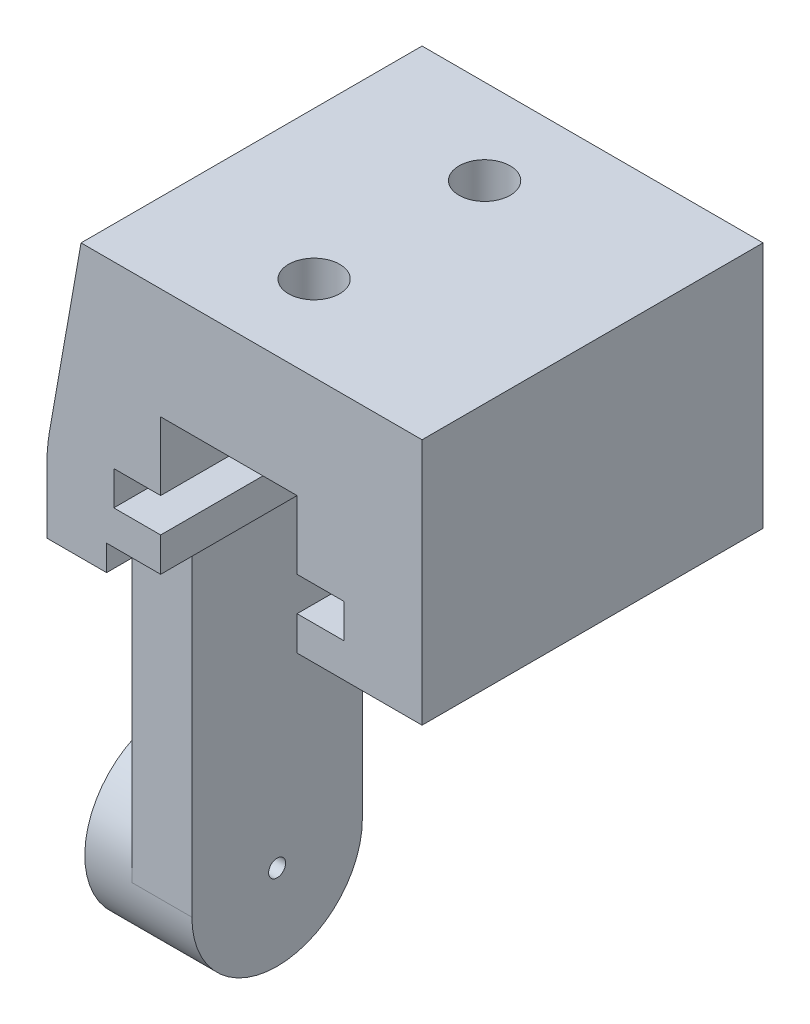
ISO-10303-21;
HEADER;
FILE_DESCRIPTION(('STEP AP214'),'2;1');
FILE_NAME('part.step','',(''),(''),'','','');
FILE_SCHEMA(('AUTOMOTIVE_DESIGN { 1 0 10303 214 1 1 1 1 }'));
ENDSEC;
DATA;
#1=APPLICATION_CONTEXT('core data for automotive mechanical design processes');
#2=APPLICATION_PROTOCOL_DEFINITION('international standard','automotive_design',2000,#1);
#3=PRODUCT_CONTEXT('',#1,'mechanical');
#4=PRODUCT('Part','Part','',(#3));
#5=PRODUCT_RELATED_PRODUCT_CATEGORY('part','',(#4));
#6=PRODUCT_DEFINITION_FORMATION('','',#4);
#7=PRODUCT_DEFINITION_CONTEXT('part definition',#1,'design');
#8=PRODUCT_DEFINITION('design','',#6,#7);
#9=PRODUCT_DEFINITION_SHAPE('','',#8);
#10=(LENGTH_UNIT() NAMED_UNIT(*) SI_UNIT(.MILLI.,.METRE.));
#11=(NAMED_UNIT(*) PLANE_ANGLE_UNIT() SI_UNIT($,.RADIAN.));
#12=(NAMED_UNIT(*) SI_UNIT($,.STERADIAN.) SOLID_ANGLE_UNIT());
#13=UNCERTAINTY_MEASURE_WITH_UNIT(LENGTH_MEASURE(1.E-05),#10,'distance_accuracy_value','');
#14=(GEOMETRIC_REPRESENTATION_CONTEXT(3) GLOBAL_UNCERTAINTY_ASSIGNED_CONTEXT((#13)) GLOBAL_UNIT_ASSIGNED_CONTEXT((#10,
#11,#12)) REPRESENTATION_CONTEXT('',''));
#15=CARTESIAN_POINT('',(0.,0.,0.));
#16=DIRECTION('',(0.,0.,1.));
#17=DIRECTION('',(1.,0.,0.));
#18=AXIS2_PLACEMENT_3D('',#15,#16,#17);
#19=CARTESIAN_POINT('',(0.,0.,20.));
#20=DIRECTION('',(1.,0.,0.));
#21=DIRECTION('',(0.,1.,0.));
#22=AXIS2_PLACEMENT_3D('',#19,#20,#21);
#23=PLANE('',#22);
#24=CARTESIAN_POINT('',(0.,-36.,10.));
#25=DIRECTION('',(-1.,0.,0.));
#26=DIRECTION('',(0.,-1.,0.));
#27=AXIS2_PLACEMENT_3D('',#24,#25,#26);
#28=CIRCLE('',#27,5.00000000000001);
#29=CARTESIAN_POINT('',(0.,-36.,15.));
#30=VERTEX_POINT('',#29);
#31=CARTESIAN_POINT('',(0.,-36.,5.));
#32=VERTEX_POINT('',#31);
#33=EDGE_CURVE('E219',#30,#32,#28,.T.);
#34=ORIENTED_EDGE('',*,*,#33,.F.);
#35=DIRECTION('',(0.,1.,0.));
#36=VECTOR('',#35,1.);
#37=CARTESIAN_POINT('',(0.,-36.,15.));
#38=LINE('',#37,#36);
#39=CARTESIAN_POINT('',(0.,-17.,15.));
#40=VERTEX_POINT('',#39);
#41=EDGE_CURVE('E225',#30,#40,#38,.T.);
#42=ORIENTED_EDGE('',*,*,#41,.T.);
#43=CARTESIAN_POINT('',(0.,-17.,16.));
#44=DIRECTION('',(1.,0.,0.));
#45=DIRECTION('',(0.,1.,0.));
#46=AXIS2_PLACEMENT_3D('',#43,#44,#45);
#47=CIRCLE('',#46,1.);
#48=CARTESIAN_POINT('',(0.,-16.,16.));
#49=VERTEX_POINT('',#48);
#50=EDGE_CURVE('E48',#40,#49,#47,.T.);
#51=ORIENTED_EDGE('',*,*,#50,.T.);
#52=DIRECTION('',(0.,0.,-1.));
#53=VECTOR('',#52,1.);
#54=CARTESIAN_POINT('',(0.,-16.,20.));
#55=LINE('',#54,#53);
#56=CARTESIAN_POINT('',(0.,-16.,20.));
#57=VERTEX_POINT('',#56);
#58=EDGE_CURVE('E418',#57,#49,#55,.T.);
#59=ORIENTED_EDGE('',*,*,#58,.F.);
#60=DIRECTION('',(0.,-1.,0.));
#61=VECTOR('',#60,1.);
#62=CARTESIAN_POINT('',(0.,0.,20.));
#63=LINE('',#62,#61);
#64=CARTESIAN_POINT('',(0.,-12.2174502744946,20.));
#65=VERTEX_POINT('',#64);
#66=EDGE_CURVE('E503',#65,#57,#63,.T.);
#67=ORIENTED_EDGE('',*,*,#66,.F.);
#68=DIRECTION('',(0.,0.,1.));
#69=VECTOR('',#68,1.);
#70=CARTESIAN_POINT('',(0.,-12.2174502744946,0.));
#71=LINE('',#70,#69);
#72=CARTESIAN_POINT('',(0.,-12.2174502744946,0.));
#73=VERTEX_POINT('',#72);
#74=EDGE_CURVE('E477',#65,#73,#71,.F.);
#75=ORIENTED_EDGE('',*,*,#74,.T.);
#76=DIRECTION('',(0.,-1.,0.));
#77=VECTOR('',#76,1.);
#78=CARTESIAN_POINT('',(0.,0.,0.));
#79=LINE('',#78,#77);
#80=CARTESIAN_POINT('',(0.,-16.,0.));
#81=VERTEX_POINT('',#80);
#82=EDGE_CURVE('E326',#73,#81,#79,.T.);
#83=ORIENTED_EDGE('',*,*,#82,.T.);
#84=CARTESIAN_POINT('',(0.,-16.,4.));
#85=VERTEX_POINT('',#84);
#86=EDGE_CURVE('E423',#85,#81,#55,.T.);
#87=ORIENTED_EDGE('',*,*,#86,.F.);
#88=CARTESIAN_POINT('',(0.,-17.,4.));
#89=DIRECTION('',(1.,0.,0.));
#90=DIRECTION('',(0.,1.,0.));
#91=AXIS2_PLACEMENT_3D('',#88,#89,#90);
#92=CIRCLE('',#91,1.);
#93=CARTESIAN_POINT('',(0.,-17.,5.));
#94=VERTEX_POINT('',#93);
#95=EDGE_CURVE('E445',#85,#94,#92,.T.);
#96=ORIENTED_EDGE('',*,*,#95,.T.);
#97=DIRECTION('',(0.,1.,0.));
#98=VECTOR('',#97,1.);
#99=CARTESIAN_POINT('',(0.,-36.,5.));
#100=LINE('',#99,#98);
#101=EDGE_CURVE('E237',#32,#94,#100,.T.);
#102=ORIENTED_EDGE('',*,*,#101,.F.);
#103=EDGE_LOOP('',(#34,#42,#51,#59,#67,#75,#83,#87,#96,#102));
#104=FACE_BOUND('',#103,.T.);
#105=ADVANCED_FACE('F39',(#104),#23,.F.);
#106=CARTESIAN_POINT('',(0.,-16.,20.));
#107=DIRECTION('',(0.,1.,0.));
#108=DIRECTION('',(0.,0.,1.));
#109=AXIS2_PLACEMENT_3D('',#106,#107,#108);
#110=PLANE('',#109);
#111=ORIENTED_EDGE('',*,*,#58,.T.);
#112=DIRECTION('',(-1.,0.,0.));
#113=VECTOR('',#112,1.);
#114=CARTESIAN_POINT('',(3.5,-16.,16.));
#115=LINE('',#114,#113);
#116=CARTESIAN_POINT('',(3.5,-16.,16.));
#117=VERTEX_POINT('',#116);
#118=EDGE_CURVE('E61',#49,#117,#115,.F.);
#119=ORIENTED_EDGE('',*,*,#118,.T.);
#120=DIRECTION('',(0.,0.,1.));
#121=VECTOR('',#120,1.);
#122=CARTESIAN_POINT('',(3.5,-16.,-20.7966343430854));
#123=LINE('',#122,#121);
#124=CARTESIAN_POINT('',(3.5,-16.,20.));
#125=VERTEX_POINT('',#124);
#126=EDGE_CURVE('E401',#117,#125,#123,.T.);
#127=ORIENTED_EDGE('',*,*,#126,.T.);
#128=DIRECTION('',(1.,0.,0.));
#129=VECTOR('',#128,1.);
#130=CARTESIAN_POINT('',(0.,-16.,20.));
#131=LINE('',#130,#129);
#132=EDGE_CURVE('E559',#57,#125,#131,.T.);
#133=ORIENTED_EDGE('',*,*,#132,.F.);
#134=EDGE_LOOP('',(#111,#119,#127,#133));
#135=FACE_BOUND('',#134,.T.);
#136=ADVANCED_FACE('F618',(#135),#110,.F.);
#137=CARTESIAN_POINT('',(3.5,-16.,0.));
#138=VERTEX_POINT('',#137);
#139=CARTESIAN_POINT('',(3.5,-16.,4.));
#140=VERTEX_POINT('',#139);
#141=EDGE_CURVE('E411',#138,#140,#123,.T.);
#142=ORIENTED_EDGE('',*,*,#141,.T.);
#143=DIRECTION('',(1.,0.,0.));
#144=VECTOR('',#143,1.);
#145=CARTESIAN_POINT('',(0.,-16.,4.));
#146=LINE('',#145,#144);
#147=EDGE_CURVE('E439',#140,#85,#146,.F.);
#148=ORIENTED_EDGE('',*,*,#147,.T.);
#149=ORIENTED_EDGE('',*,*,#86,.T.);
#150=DIRECTION('',(1.,0.,0.));
#151=VECTOR('',#150,1.);
#152=CARTESIAN_POINT('',(0.,-16.,0.));
#153=LINE('',#152,#151);
#154=EDGE_CURVE('E513',#81,#138,#153,.T.);
#155=ORIENTED_EDGE('',*,*,#154,.T.);
#156=EDGE_LOOP('',(#142,#148,#149,#155));
#157=FACE_BOUND('',#156,.T.);
#158=ADVANCED_FACE('F616',(#157),#110,.F.);
#159=CARTESIAN_POINT('',(22.,0.,20.));
#160=DIRECTION('',(-1.,0.,0.));
#161=DIRECTION('',(0.,-1.,0.));
#162=AXIS2_PLACEMENT_3D('',#159,#160,#161);
#163=PLANE('',#162);
#164=DIRECTION('',(0.,0.,1.));
#165=VECTOR('',#164,1.);
#166=CARTESIAN_POINT('',(22.,-14.5,-20.7966343430854));
#167=LINE('',#166,#165);
#168=CARTESIAN_POINT('',(22.,-14.5,0.));
#169=VERTEX_POINT('',#168);
#170=CARTESIAN_POINT('',(22.,-14.5,20.));
#171=VERTEX_POINT('',#170);
#172=EDGE_CURVE('E404',#169,#171,#167,.T.);
#173=ORIENTED_EDGE('',*,*,#172,.F.);
#174=DIRECTION('',(0.,1.,0.));
#175=VECTOR('',#174,1.);
#176=CARTESIAN_POINT('',(22.,0.,0.));
#177=LINE('',#176,#175);
#178=CARTESIAN_POINT('',(22.,0.,0.));
#179=VERTEX_POINT('',#178);
#180=EDGE_CURVE('E504',#169,#179,#177,.T.);
#181=ORIENTED_EDGE('',*,*,#180,.T.);
#182=DIRECTION('',(0.,0.,-1.));
#183=VECTOR('',#182,1.);
#184=CARTESIAN_POINT('',(22.,0.,20.));
#185=LINE('',#184,#183);
#186=CARTESIAN_POINT('',(22.,0.,20.));
#187=VERTEX_POINT('',#186);
#188=EDGE_CURVE('E429',#187,#179,#185,.T.);
#189=ORIENTED_EDGE('',*,*,#188,.F.);
#190=DIRECTION('',(0.,1.,0.));
#191=VECTOR('',#190,1.);
#192=CARTESIAN_POINT('',(22.,0.,20.));
#193=LINE('',#192,#191);
#194=EDGE_CURVE('E562',#171,#187,#193,.T.);
#195=ORIENTED_EDGE('',*,*,#194,.F.);
#196=EDGE_LOOP('',(#173,#181,#189,#195));
#197=FACE_BOUND('',#196,.T.);
#198=ADVANCED_FACE('F524',(#197),#163,.F.);
#199=CARTESIAN_POINT('',(0.,0.,20.));
#200=DIRECTION('',(0.,0.,1.));
#201=DIRECTION('',(1.,0.,0.));
#202=AXIS2_PLACEMENT_3D('',#199,#200,#201);
#203=PLANE('',#202);
#204=DIRECTION('',(0.173648177666931,0.984807753012208,0.));
#205=VECTOR('',#204,1.);
#206=CARTESIAN_POINT('',(1.93969262078591,-0.34202014332567,20.));
#207=LINE('',#206,#205);
#208=CARTESIAN_POINT('',(2.,0.,20.));
#209=VERTEX_POINT('',#208);
#210=CARTESIAN_POINT('',(0.151922469877919,-10.4809684978253,20.));
#211=VERTEX_POINT('',#210);
#212=EDGE_CURVE('E483',#209,#211,#207,.F.);
#213=ORIENTED_EDGE('',*,*,#212,.T.);
#214=CARTESIAN_POINT('',(10.,-12.2174502744946,20.));
#215=DIRECTION('',(0.,0.,1.));
#216=DIRECTION('',(1.,0.,0.));
#217=AXIS2_PLACEMENT_3D('',#214,#215,#216);
#218=CIRCLE('',#217,10.);
#219=EDGE_CURVE('E416',#211,#65,#218,.T.);
#220=ORIENTED_EDGE('',*,*,#219,.T.);
#221=ORIENTED_EDGE('',*,*,#66,.T.);
#222=ORIENTED_EDGE('',*,*,#132,.T.);
#223=DIRECTION('',(0.,1.,0.));
#224=VECTOR('',#223,1.);
#225=CARTESIAN_POINT('',(3.5,-16.,20.));
#226=LINE('',#225,#224);
#227=CARTESIAN_POINT('',(3.5,-14.5,20.));
#228=VERTEX_POINT('',#227);
#229=EDGE_CURVE('E359',#125,#228,#226,.T.);
#230=ORIENTED_EDGE('',*,*,#229,.T.);
#231=DIRECTION('',(1.,0.,0.));
#232=VECTOR('',#231,1.);
#233=CARTESIAN_POINT('',(3.5,-14.5,20.));
#234=LINE('',#233,#232);
#235=CARTESIAN_POINT('',(6.67,-14.5,20.));
#236=VERTEX_POINT('',#235);
#237=EDGE_CURVE('E363',#228,#236,#234,.T.);
#238=ORIENTED_EDGE('',*,*,#237,.T.);
#239=DIRECTION('',(0.,1.,0.));
#240=VECTOR('',#239,1.);
#241=CARTESIAN_POINT('',(6.67,-14.5,20.));
#242=LINE('',#241,#240);
#243=CARTESIAN_POINT('',(6.67,-12.5,20.));
#244=VERTEX_POINT('',#243);
#245=EDGE_CURVE('E367',#236,#244,#242,.T.);
#246=ORIENTED_EDGE('',*,*,#245,.T.);
#247=DIRECTION('',(-1.,0.,0.));
#248=VECTOR('',#247,1.);
#249=CARTESIAN_POINT('',(6.67,-12.5,20.));
#250=LINE('',#249,#248);
#251=CARTESIAN_POINT('',(3.92,-12.5,20.));
#252=VERTEX_POINT('',#251);
#253=EDGE_CURVE('E371',#244,#252,#250,.T.);
#254=ORIENTED_EDGE('',*,*,#253,.T.);
#255=DIRECTION('',(0.,1.,0.));
#256=VECTOR('',#255,1.);
#257=CARTESIAN_POINT('',(3.92,-12.5,20.));
#258=LINE('',#257,#256);
#259=CARTESIAN_POINT('',(3.92,-10.5,20.));
#260=VERTEX_POINT('',#259);
#261=EDGE_CURVE('E375',#252,#260,#258,.T.);
#262=ORIENTED_EDGE('',*,*,#261,.T.);
#263=DIRECTION('',(1.,0.,0.));
#264=VECTOR('',#263,1.);
#265=CARTESIAN_POINT('',(3.92,-10.5,20.));
#266=LINE('',#265,#264);
#267=CARTESIAN_POINT('',(6.67,-10.5,20.));
#268=VERTEX_POINT('',#267);
#269=EDGE_CURVE('E379',#260,#268,#266,.T.);
#270=ORIENTED_EDGE('',*,*,#269,.T.);
#271=DIRECTION('',(0.,1.,0.));
#272=VECTOR('',#271,1.);
#273=CARTESIAN_POINT('',(6.67,-10.5,20.));
#274=LINE('',#273,#272);
#275=CARTESIAN_POINT('',(6.67,-6.5,20.));
#276=VERTEX_POINT('',#275);
#277=EDGE_CURVE('E327',#268,#276,#274,.T.);
#278=ORIENTED_EDGE('',*,*,#277,.T.);
#279=DIRECTION('',(1.,0.,0.));
#280=VECTOR('',#279,1.);
#281=CARTESIAN_POINT('',(6.67,-6.5,20.));
#282=LINE('',#281,#280);
#283=CARTESIAN_POINT('',(14.67,-6.5,20.));
#284=VERTEX_POINT('',#283);
#285=EDGE_CURVE('E331',#276,#284,#282,.T.);
#286=ORIENTED_EDGE('',*,*,#285,.T.);
#287=DIRECTION('',(0.,-1.,0.));
#288=VECTOR('',#287,1.);
#289=CARTESIAN_POINT('',(14.67,-6.5,20.));
#290=LINE('',#289,#288);
#291=CARTESIAN_POINT('',(14.67,-10.5,20.));
#292=VERTEX_POINT('',#291);
#293=EDGE_CURVE('E335',#284,#292,#290,.T.);
#294=ORIENTED_EDGE('',*,*,#293,.T.);
#295=DIRECTION('',(1.,0.,0.));
#296=VECTOR('',#295,1.);
#297=CARTESIAN_POINT('',(14.67,-10.5,20.));
#298=LINE('',#297,#296);
#299=CARTESIAN_POINT('',(17.42,-10.5,20.));
#300=VERTEX_POINT('',#299);
#301=EDGE_CURVE('E339',#292,#300,#298,.T.);
#302=ORIENTED_EDGE('',*,*,#301,.T.);
#303=DIRECTION('',(0.,-1.,0.));
#304=VECTOR('',#303,1.);
#305=CARTESIAN_POINT('',(17.42,-10.5,20.));
#306=LINE('',#305,#304);
#307=CARTESIAN_POINT('',(17.42,-12.5,20.));
#308=VERTEX_POINT('',#307);
#309=EDGE_CURVE('E343',#300,#308,#306,.T.);
#310=ORIENTED_EDGE('',*,*,#309,.T.);
#311=DIRECTION('',(-1.,0.,0.));
#312=VECTOR('',#311,1.);
#313=CARTESIAN_POINT('',(17.42,-12.5,20.));
#314=LINE('',#313,#312);
#315=CARTESIAN_POINT('',(14.67,-12.5,20.));
#316=VERTEX_POINT('',#315);
#317=EDGE_CURVE('E347',#308,#316,#314,.T.);
#318=ORIENTED_EDGE('',*,*,#317,.T.);
#319=DIRECTION('',(0.,-1.,0.));
#320=VECTOR('',#319,1.);
#321=CARTESIAN_POINT('',(14.67,-12.5,20.));
#322=LINE('',#321,#320);
#323=CARTESIAN_POINT('',(14.67,-14.5,20.));
#324=VERTEX_POINT('',#323);
#325=EDGE_CURVE('E351',#316,#324,#322,.T.);
#326=ORIENTED_EDGE('',*,*,#325,.T.);
#327=DIRECTION('',(1.,0.,0.));
#328=VECTOR('',#327,1.);
#329=CARTESIAN_POINT('',(14.67,-14.5,20.));
#330=LINE('',#329,#328);
#331=EDGE_CURVE('E355',#324,#171,#330,.T.);
#332=ORIENTED_EDGE('',*,*,#331,.T.);
#333=ORIENTED_EDGE('',*,*,#194,.T.);
#334=DIRECTION('',(-1.,0.,0.));
#335=VECTOR('',#334,1.);
#336=CARTESIAN_POINT('',(0.,0.,20.));
#337=LINE('',#336,#335);
#338=EDGE_CURVE('E507',#187,#209,#337,.T.);
#339=ORIENTED_EDGE('',*,*,#338,.T.);
#340=EDGE_LOOP('',(#213,#220,#221,#222,#230,#238,#246,#254,#262,#270,#278,#286,#294,#302,#310,
#318,#326,#332,#333,#339));
#341=FACE_BOUND('',#340,.T.);
#342=ADVANCED_FACE('F506',(#341),#203,.T.);
#343=CARTESIAN_POINT('',(0.,0.,0.));
#344=DIRECTION('',(0.,0.,1.));
#345=DIRECTION('',(1.,0.,0.));
#346=AXIS2_PLACEMENT_3D('',#343,#344,#345);
#347=PLANE('',#346);
#348=ORIENTED_EDGE('',*,*,#82,.F.);
#349=CARTESIAN_POINT('',(10.,-12.2174502744946,0.));
#350=DIRECTION('',(0.,0.,1.));
#351=DIRECTION('',(1.,0.,0.));
#352=AXIS2_PLACEMENT_3D('',#349,#350,#351);
#353=CIRCLE('',#352,10.);
#354=CARTESIAN_POINT('',(0.151922469877919,-10.4809684978253,0.));
#355=VERTEX_POINT('',#354);
#356=EDGE_CURVE('E471',#73,#355,#353,.F.);
#357=ORIENTED_EDGE('',*,*,#356,.T.);
#358=DIRECTION('',(-0.173648177666931,-0.984807753012208,0.));
#359=VECTOR('',#358,1.);
#360=CARTESIAN_POINT('',(0.,-11.3425636392354,0.));
#361=LINE('',#360,#359);
#362=CARTESIAN_POINT('',(2.,0.,0.));
#363=VERTEX_POINT('',#362);
#364=EDGE_CURVE('E422',#355,#363,#361,.F.);
#365=ORIENTED_EDGE('',*,*,#364,.T.);
#366=DIRECTION('',(-1.,0.,0.));
#367=VECTOR('',#366,1.);
#368=CARTESIAN_POINT('',(0.,0.,0.));
#369=LINE('',#368,#367);
#370=EDGE_CURVE('E498',#179,#363,#369,.T.);
#371=ORIENTED_EDGE('',*,*,#370,.F.);
#372=ORIENTED_EDGE('',*,*,#180,.F.);
#373=DIRECTION('',(-1.,0.,0.));
#374=VECTOR('',#373,1.);
#375=CARTESIAN_POINT('',(14.67,-14.5,0.));
#376=LINE('',#375,#374);
#377=CARTESIAN_POINT('',(14.67,-14.5,0.));
#378=VERTEX_POINT('',#377);
#379=EDGE_CURVE('E294',#169,#378,#376,.T.);
#380=ORIENTED_EDGE('',*,*,#379,.T.);
#381=DIRECTION('',(0.,1.,0.));
#382=VECTOR('',#381,1.);
#383=CARTESIAN_POINT('',(14.67,-12.5,0.));
#384=LINE('',#383,#382);
#385=CARTESIAN_POINT('',(14.67,-12.5,0.));
#386=VERTEX_POINT('',#385);
#387=EDGE_CURVE('E298',#378,#386,#384,.T.);
#388=ORIENTED_EDGE('',*,*,#387,.T.);
#389=DIRECTION('',(1.,0.,0.));
#390=VECTOR('',#389,1.);
#391=CARTESIAN_POINT('',(17.42,-12.5,0.));
#392=LINE('',#391,#390);
#393=CARTESIAN_POINT('',(17.42,-12.5,0.));
#394=VERTEX_POINT('',#393);
#395=EDGE_CURVE('E302',#386,#394,#392,.T.);
#396=ORIENTED_EDGE('',*,*,#395,.T.);
#397=DIRECTION('',(0.,1.,0.));
#398=VECTOR('',#397,1.);
#399=CARTESIAN_POINT('',(17.42,-10.5,0.));
#400=LINE('',#399,#398);
#401=CARTESIAN_POINT('',(17.42,-10.5,0.));
#402=VERTEX_POINT('',#401);
#403=EDGE_CURVE('E306',#394,#402,#400,.T.);
#404=ORIENTED_EDGE('',*,*,#403,.T.);
#405=DIRECTION('',(-1.,0.,0.));
#406=VECTOR('',#405,1.);
#407=CARTESIAN_POINT('',(14.67,-10.5,0.));
#408=LINE('',#407,#406);
#409=CARTESIAN_POINT('',(14.67,-10.5,0.));
#410=VERTEX_POINT('',#409);
#411=EDGE_CURVE('E310',#402,#410,#408,.T.);
#412=ORIENTED_EDGE('',*,*,#411,.T.);
#413=DIRECTION('',(0.,1.,0.));
#414=VECTOR('',#413,1.);
#415=CARTESIAN_POINT('',(14.67,-6.5,0.));
#416=LINE('',#415,#414);
#417=CARTESIAN_POINT('',(14.67,-6.5,0.));
#418=VERTEX_POINT('',#417);
#419=EDGE_CURVE('E314',#410,#418,#416,.T.);
#420=ORIENTED_EDGE('',*,*,#419,.T.);
#421=DIRECTION('',(-1.,0.,0.));
#422=VECTOR('',#421,1.);
#423=CARTESIAN_POINT('',(6.67,-6.5,0.));
#424=LINE('',#423,#422);
#425=CARTESIAN_POINT('',(6.67,-6.5,0.));
#426=VERTEX_POINT('',#425);
#427=EDGE_CURVE('E318',#418,#426,#424,.T.);
#428=ORIENTED_EDGE('',*,*,#427,.T.);
#429=DIRECTION('',(0.,-1.,0.));
#430=VECTOR('',#429,1.);
#431=CARTESIAN_POINT('',(6.67,-10.5,0.));
#432=LINE('',#431,#430);
#433=CARTESIAN_POINT('',(6.67,-10.5,0.));
#434=VERTEX_POINT('',#433);
#435=EDGE_CURVE('E322',#426,#434,#432,.T.);
#436=ORIENTED_EDGE('',*,*,#435,.T.);
#437=DIRECTION('',(-1.,0.,0.));
#438=VECTOR('',#437,1.);
#439=CARTESIAN_POINT('',(3.92,-10.5,0.));
#440=LINE('',#439,#438);
#441=CARTESIAN_POINT('',(3.92,-10.5,0.));
#442=VERTEX_POINT('',#441);
#443=EDGE_CURVE('E278',#434,#442,#440,.T.);
#444=ORIENTED_EDGE('',*,*,#443,.T.);
#445=DIRECTION('',(0.,-1.,0.));
#446=VECTOR('',#445,1.);
#447=CARTESIAN_POINT('',(3.92,-12.5,0.));
#448=LINE('',#447,#446);
#449=CARTESIAN_POINT('',(3.92,-12.5,0.));
#450=VERTEX_POINT('',#449);
#451=EDGE_CURVE('E273',#442,#450,#448,.T.);
#452=ORIENTED_EDGE('',*,*,#451,.T.);
#453=DIRECTION('',(1.,0.,0.));
#454=VECTOR('',#453,1.);
#455=CARTESIAN_POINT('',(6.67,-12.5,0.));
#456=LINE('',#455,#454);
#457=CARTESIAN_POINT('',(6.67,-12.5,0.));
#458=VERTEX_POINT('',#457);
#459=EDGE_CURVE('E277',#450,#458,#456,.T.);
#460=ORIENTED_EDGE('',*,*,#459,.T.);
#461=DIRECTION('',(0.,-1.,0.));
#462=VECTOR('',#461,1.);
#463=CARTESIAN_POINT('',(6.67,-14.5,0.));
#464=LINE('',#463,#462);
#465=CARTESIAN_POINT('',(6.67,-14.5,0.));
#466=VERTEX_POINT('',#465);
#467=EDGE_CURVE('E282',#458,#466,#464,.T.);
#468=ORIENTED_EDGE('',*,*,#467,.T.);
#469=DIRECTION('',(-1.,0.,0.));
#470=VECTOR('',#469,1.);
#471=CARTESIAN_POINT('',(3.5,-14.5,0.));
#472=LINE('',#471,#470);
#473=CARTESIAN_POINT('',(3.5,-14.5,0.));
#474=VERTEX_POINT('',#473);
#475=EDGE_CURVE('E286',#466,#474,#472,.T.);
#476=ORIENTED_EDGE('',*,*,#475,.T.);
#477=DIRECTION('',(0.,-1.,0.));
#478=VECTOR('',#477,1.);
#479=CARTESIAN_POINT('',(3.5,-16.,0.));
#480=LINE('',#479,#478);
#481=EDGE_CURVE('E290',#474,#138,#480,.T.);
#482=ORIENTED_EDGE('',*,*,#481,.T.);
#483=ORIENTED_EDGE('',*,*,#154,.F.);
#484=EDGE_LOOP('',(#348,#357,#365,#371,#372,#380,#388,#396,#404,#412,#420,#428,#436,#444,#452,
#460,#468,#476,#482,#483));
#485=FACE_BOUND('',#484,.T.);
#486=ADVANCED_FACE('F496',(#485),#347,.F.);
#487=CARTESIAN_POINT('',(0.,0.,20.));
#488=DIRECTION('',(0.,-1.,0.));
#489=DIRECTION('',(0.,0.,-1.));
#490=AXIS2_PLACEMENT_3D('',#487,#488,#489);
#491=PLANE('',#490);
#492=CARTESIAN_POINT('',(10.67,0.,5.));
#493=DIRECTION('',(0.,-1.,0.));
#494=DIRECTION('',(0.,0.,-1.));
#495=AXIS2_PLACEMENT_3D('',#492,#493,#494);
#496=CIRCLE('',#495,1.5);
#497=CARTESIAN_POINT('',(10.67,0.,3.5));
#498=VERTEX_POINT('',#497);
#499=EDGE_CURVE('E253',#498,#498,#496,.F.);
#500=ORIENTED_EDGE('',*,*,#499,.F.);
#501=EDGE_LOOP('',(#500));
#502=FACE_BOUND('',#501,.T.);
#503=CARTESIAN_POINT('',(10.67,0.,15.));
#504=DIRECTION('',(0.,-1.,0.));
#505=DIRECTION('',(0.,0.,-1.));
#506=AXIS2_PLACEMENT_3D('',#503,#504,#505);
#507=CIRCLE('',#506,1.5);
#508=CARTESIAN_POINT('',(10.67,0.,13.5));
#509=VERTEX_POINT('',#508);
#510=EDGE_CURVE('E261',#509,#509,#507,.F.);
#511=ORIENTED_EDGE('',*,*,#510,.F.);
#512=EDGE_LOOP('',(#511));
#513=FACE_BOUND('',#512,.T.);
#514=ORIENTED_EDGE('',*,*,#370,.T.);
#515=DIRECTION('',(0.,0.,1.));
#516=VECTOR('',#515,1.);
#517=CARTESIAN_POINT('',(2.,0.,20.));
#518=LINE('',#517,#516);
#519=EDGE_CURVE('E485',#363,#209,#518,.T.);
#520=ORIENTED_EDGE('',*,*,#519,.T.);
#521=ORIENTED_EDGE('',*,*,#338,.F.);
#522=ORIENTED_EDGE('',*,*,#188,.T.);
#523=EDGE_LOOP('',(#514,#520,#521,#522));
#524=FACE_BOUND('',#523,.T.);
#525=ADVANCED_FACE('F500',(#502,#513,#524),#491,.F.);
#526=CARTESIAN_POINT('',(0.,-11.3425636392354,20.));
#527=DIRECTION('',(0.984807753012208,-0.173648177666931,0.));
#528=DIRECTION('',(0.,0.,-1.));
#529=AXIS2_PLACEMENT_3D('',#526,#527,#528);
#530=PLANE('',#529);
#531=ORIENTED_EDGE('',*,*,#364,.F.);
#532=DIRECTION('',(0.,0.,-1.));
#533=VECTOR('',#532,1.);
#534=CARTESIAN_POINT('',(0.151922469877919,-10.4809684978253,20.));
#535=LINE('',#534,#533);
#536=EDGE_CURVE('E465',#355,#211,#535,.F.);
#537=ORIENTED_EDGE('',*,*,#536,.T.);
#538=ORIENTED_EDGE('',*,*,#212,.F.);
#539=ORIENTED_EDGE('',*,*,#519,.F.);
#540=EDGE_LOOP('',(#531,#537,#538,#539));
#541=FACE_BOUND('',#540,.T.);
#542=ADVANCED_FACE('F505',(#541),#530,.F.);
#543=CARTESIAN_POINT('',(3.92,-10.5,-20.7966343430854));
#544=DIRECTION('',(0.,-1.,0.));
#545=DIRECTION('',(1.,0.,0.));
#546=AXIS2_PLACEMENT_3D('',#543,#544,#545);
#547=PLANE('',#546);
#548=DIRECTION('',(0.,0.,1.));
#549=VECTOR('',#548,1.);
#550=CARTESIAN_POINT('',(6.67,-10.5,-20.7966343430854));
#551=LINE('',#550,#549);
#552=EDGE_CURVE('E383',#434,#268,#551,.T.);
#553=ORIENTED_EDGE('',*,*,#552,.T.);
#554=ORIENTED_EDGE('',*,*,#269,.F.);
#555=DIRECTION('',(0.,0.,1.));
#556=VECTOR('',#555,1.);
#557=CARTESIAN_POINT('',(3.92,-10.5,-20.7966343430854));
#558=LINE('',#557,#556);
#559=EDGE_CURVE('E386',#442,#260,#558,.T.);
#560=ORIENTED_EDGE('',*,*,#559,.F.);
#561=ORIENTED_EDGE('',*,*,#443,.F.);
#562=EDGE_LOOP('',(#553,#554,#560,#561));
#563=FACE_BOUND('',#562,.T.);
#564=ADVANCED_FACE('F595',(#563),#547,.T.);
#565=CARTESIAN_POINT('',(3.92,-12.5,-20.7966343430854));
#566=DIRECTION('',(1.,0.,0.));
#567=DIRECTION('',(0.,0.,-1.));
#568=AXIS2_PLACEMENT_3D('',#565,#566,#567);
#569=PLANE('',#568);
#570=ORIENTED_EDGE('',*,*,#559,.T.);
#571=ORIENTED_EDGE('',*,*,#261,.F.);
#572=DIRECTION('',(0.,0.,1.));
#573=VECTOR('',#572,1.);
#574=CARTESIAN_POINT('',(3.92,-12.5,-20.7966343430854));
#575=LINE('',#574,#573);
#576=EDGE_CURVE('E389',#450,#252,#575,.T.);
#577=ORIENTED_EDGE('',*,*,#576,.F.);
#578=ORIENTED_EDGE('',*,*,#451,.F.);
#579=EDGE_LOOP('',(#570,#571,#577,#578));
#580=FACE_BOUND('',#579,.T.);
#581=ADVANCED_FACE('F598',(#580),#569,.T.);
#582=CARTESIAN_POINT('',(6.67,-12.5,-20.7966343430854));
#583=DIRECTION('',(0.,1.,0.));
#584=DIRECTION('',(-1.,0.,0.));
#585=AXIS2_PLACEMENT_3D('',#582,#583,#584);
#586=PLANE('',#585);
#587=ORIENTED_EDGE('',*,*,#576,.T.);
#588=ORIENTED_EDGE('',*,*,#253,.F.);
#589=DIRECTION('',(0.,0.,1.));
#590=VECTOR('',#589,1.);
#591=CARTESIAN_POINT('',(6.67,-12.5,-20.7966343430854));
#592=LINE('',#591,#590);
#593=EDGE_CURVE('E392',#458,#244,#592,.T.);
#594=ORIENTED_EDGE('',*,*,#593,.F.);
#595=ORIENTED_EDGE('',*,*,#459,.F.);
#596=EDGE_LOOP('',(#587,#588,#594,#595));
#597=FACE_BOUND('',#596,.T.);
#598=ADVANCED_FACE('F602',(#597),#586,.T.);
#599=CARTESIAN_POINT('',(6.67,-14.5,-20.7966343430854));
#600=DIRECTION('',(1.,0.,0.));
#601=DIRECTION('',(0.,0.,-1.));
#602=AXIS2_PLACEMENT_3D('',#599,#600,#601);
#603=PLANE('',#602);
#604=ORIENTED_EDGE('',*,*,#593,.T.);
#605=ORIENTED_EDGE('',*,*,#245,.F.);
#606=DIRECTION('',(0.,0.,1.));
#607=VECTOR('',#606,1.);
#608=CARTESIAN_POINT('',(6.67,-14.5,-20.7966343430854));
#609=LINE('',#608,#607);
#610=EDGE_CURVE('E395',#466,#236,#609,.T.);
#611=ORIENTED_EDGE('',*,*,#610,.F.);
#612=ORIENTED_EDGE('',*,*,#467,.F.);
#613=EDGE_LOOP('',(#604,#605,#611,#612));
#614=FACE_BOUND('',#613,.T.);
#615=ADVANCED_FACE('F606',(#614),#603,.T.);
#616=CARTESIAN_POINT('',(3.5,-14.5,-20.7966343430854));
#617=DIRECTION('',(0.,-1.,0.));
#618=DIRECTION('',(0.,0.,-1.));
#619=AXIS2_PLACEMENT_3D('',#616,#617,#618);
#620=PLANE('',#619);
#621=ORIENTED_EDGE('',*,*,#610,.T.);
#622=ORIENTED_EDGE('',*,*,#237,.F.);
#623=DIRECTION('',(0.,0.,1.));
#624=VECTOR('',#623,1.);
#625=CARTESIAN_POINT('',(3.5,-14.5,-20.7966343430854));
#626=LINE('',#625,#624);
#627=EDGE_CURVE('E398',#474,#228,#626,.T.);
#628=ORIENTED_EDGE('',*,*,#627,.F.);
#629=ORIENTED_EDGE('',*,*,#475,.F.);
#630=EDGE_LOOP('',(#621,#622,#628,#629));
#631=FACE_BOUND('',#630,.T.);
#632=ADVANCED_FACE('F610',(#631),#620,.T.);
#633=CARTESIAN_POINT('',(3.5,-16.,-20.7966343430854));
#634=DIRECTION('',(1.,0.,0.));
#635=DIRECTION('',(0.,0.,-1.));
#636=AXIS2_PLACEMENT_3D('',#633,#634,#635);
#637=PLANE('',#636);
#638=CARTESIAN_POINT('',(3.5,-36.,10.));
#639=DIRECTION('',(1.,0.,0.));
#640=DIRECTION('',(0.,0.,-1.));
#641=AXIS2_PLACEMENT_3D('',#638,#639,#640);
#642=CIRCLE('',#641,0.500000000000001);
#643=CARTESIAN_POINT('',(3.5,-36.,9.5));
#644=VERTEX_POINT('',#643);
#645=EDGE_CURVE('E265',#644,#644,#642,.F.);
#646=ORIENTED_EDGE('',*,*,#645,.T.);
#647=EDGE_LOOP('',(#646));
#648=FACE_BOUND('',#647,.T.);
#649=ORIENTED_EDGE('',*,*,#627,.T.);
#650=ORIENTED_EDGE('',*,*,#229,.F.);
#651=ORIENTED_EDGE('',*,*,#126,.F.);
#652=CARTESIAN_POINT('',(3.5,-17.,16.));
#653=DIRECTION('',(1.,0.,0.));
#654=DIRECTION('',(0.,0.,-1.));
#655=AXIS2_PLACEMENT_3D('',#652,#653,#654);
#656=CIRCLE('',#655,1.);
#657=CARTESIAN_POINT('',(3.5,-17.,15.));
#658=VERTEX_POINT('',#657);
#659=EDGE_CURVE('E11',#117,#658,#656,.F.);
#660=ORIENTED_EDGE('',*,*,#659,.T.);
#661=DIRECTION('',(0.,1.,0.));
#662=VECTOR('',#661,1.);
#663=CARTESIAN_POINT('',(3.5,-36.,15.));
#664=LINE('',#663,#662);
#665=CARTESIAN_POINT('',(3.5,-36.,15.));
#666=VERTEX_POINT('',#665);
#667=EDGE_CURVE('E233',#666,#658,#664,.T.);
#668=ORIENTED_EDGE('',*,*,#667,.F.);
#669=CARTESIAN_POINT('',(3.5,-36.,10.));
#670=DIRECTION('',(1.,0.,0.));
#671=DIRECTION('',(0.,0.,-1.));
#672=AXIS2_PLACEMENT_3D('',#669,#670,#671);
#673=CIRCLE('',#672,5.);
#674=CARTESIAN_POINT('',(3.50000000000001,-36.,5.));
#675=VERTEX_POINT('',#674);
#676=EDGE_CURVE('E221',#675,#666,#673,.F.);
#677=ORIENTED_EDGE('',*,*,#676,.F.);
#678=DIRECTION('',(0.,1.,0.));
#679=VECTOR('',#678,1.);
#680=CARTESIAN_POINT('',(3.5,-36.,5.));
#681=LINE('',#680,#679);
#682=CARTESIAN_POINT('',(3.5,-17.,5.));
#683=VERTEX_POINT('',#682);
#684=EDGE_CURVE('E424',#675,#683,#681,.T.);
#685=ORIENTED_EDGE('',*,*,#684,.T.);
#686=CARTESIAN_POINT('',(3.5,-17.,4.));
#687=DIRECTION('',(1.,0.,0.));
#688=DIRECTION('',(0.,0.,-1.));
#689=AXIS2_PLACEMENT_3D('',#686,#687,#688);
#690=CIRCLE('',#689,1.);
#691=EDGE_CURVE('E443',#683,#140,#690,.F.);
#692=ORIENTED_EDGE('',*,*,#691,.T.);
#693=ORIENTED_EDGE('',*,*,#141,.F.);
#694=ORIENTED_EDGE('',*,*,#481,.F.);
#695=EDGE_LOOP('',(#649,#650,#651,#660,#668,#677,#685,#692,#693,#694));
#696=FACE_BOUND('',#695,.T.);
#697=ADVANCED_FACE('F614',(#648,#696),#637,.T.);
#698=CARTESIAN_POINT('',(14.67,-14.5,-20.7966343430854));
#699=DIRECTION('',(0.,-1.,0.));
#700=DIRECTION('',(0.,0.,-1.));
#701=AXIS2_PLACEMENT_3D('',#698,#699,#700);
#702=PLANE('',#701);
#703=ORIENTED_EDGE('',*,*,#172,.T.);
#704=ORIENTED_EDGE('',*,*,#331,.F.);
#705=DIRECTION('',(0.,0.,1.));
#706=VECTOR('',#705,1.);
#707=CARTESIAN_POINT('',(14.67,-14.5,-20.7966343430854));
#708=LINE('',#707,#706);
#709=EDGE_CURVE('E530',#378,#324,#708,.T.);
#710=ORIENTED_EDGE('',*,*,#709,.F.);
#711=ORIENTED_EDGE('',*,*,#379,.F.);
#712=EDGE_LOOP('',(#703,#704,#710,#711));
#713=FACE_BOUND('',#712,.T.);
#714=ADVANCED_FACE('F528',(#713),#702,.T.);
#715=CARTESIAN_POINT('',(14.67,-12.5,-20.7966343430854));
#716=DIRECTION('',(-1.,0.,0.));
#717=DIRECTION('',(0.,0.,1.));
#718=AXIS2_PLACEMENT_3D('',#715,#716,#717);
#719=PLANE('',#718);
#720=ORIENTED_EDGE('',*,*,#709,.T.);
#721=ORIENTED_EDGE('',*,*,#325,.F.);
#722=DIRECTION('',(0.,0.,1.));
#723=VECTOR('',#722,1.);
#724=CARTESIAN_POINT('',(14.67,-12.5,-20.7966343430854));
#725=LINE('',#724,#723);
#726=EDGE_CURVE('E534',#386,#316,#725,.T.);
#727=ORIENTED_EDGE('',*,*,#726,.F.);
#728=ORIENTED_EDGE('',*,*,#387,.F.);
#729=EDGE_LOOP('',(#720,#721,#727,#728));
#730=FACE_BOUND('',#729,.T.);
#731=ADVANCED_FACE('F568',(#730),#719,.T.);
#732=CARTESIAN_POINT('',(17.42,-12.5,-20.7966343430854));
#733=DIRECTION('',(0.,1.,0.));
#734=DIRECTION('',(0.,0.,1.));
#735=AXIS2_PLACEMENT_3D('',#732,#733,#734);
#736=PLANE('',#735);
#737=ORIENTED_EDGE('',*,*,#726,.T.);
#738=ORIENTED_EDGE('',*,*,#317,.F.);
#739=DIRECTION('',(0.,0.,1.));
#740=VECTOR('',#739,1.);
#741=CARTESIAN_POINT('',(17.42,-12.5,-20.7966343430854));
#742=LINE('',#741,#740);
#743=EDGE_CURVE('E537',#394,#308,#742,.T.);
#744=ORIENTED_EDGE('',*,*,#743,.F.);
#745=ORIENTED_EDGE('',*,*,#395,.F.);
#746=EDGE_LOOP('',(#737,#738,#744,#745));
#747=FACE_BOUND('',#746,.T.);
#748=ADVANCED_FACE('F570',(#747),#736,.T.);
#749=CARTESIAN_POINT('',(17.42,-10.5,-20.7966343430854));
#750=DIRECTION('',(-1.,0.,0.));
#751=DIRECTION('',(0.,0.,1.));
#752=AXIS2_PLACEMENT_3D('',#749,#750,#751);
#753=PLANE('',#752);
#754=ORIENTED_EDGE('',*,*,#743,.T.);
#755=ORIENTED_EDGE('',*,*,#309,.F.);
#756=DIRECTION('',(0.,0.,1.));
#757=VECTOR('',#756,1.);
#758=CARTESIAN_POINT('',(17.42,-10.5,-20.7966343430854));
#759=LINE('',#758,#757);
#760=EDGE_CURVE('E542',#402,#300,#759,.T.);
#761=ORIENTED_EDGE('',*,*,#760,.F.);
#762=ORIENTED_EDGE('',*,*,#403,.F.);
#763=EDGE_LOOP('',(#754,#755,#761,#762));
#764=FACE_BOUND('',#763,.T.);
#765=ADVANCED_FACE('F574',(#764),#753,.T.);
#766=CARTESIAN_POINT('',(14.67,-10.5,-20.7966343430854));
#767=DIRECTION('',(0.,-1.,0.));
#768=DIRECTION('',(0.,0.,-1.));
#769=AXIS2_PLACEMENT_3D('',#766,#767,#768);
#770=PLANE('',#769);
#771=ORIENTED_EDGE('',*,*,#760,.T.);
#772=ORIENTED_EDGE('',*,*,#301,.F.);
#773=DIRECTION('',(0.,0.,1.));
#774=VECTOR('',#773,1.);
#775=CARTESIAN_POINT('',(14.67,-10.5,-20.7966343430854));
#776=LINE('',#775,#774);
#777=EDGE_CURVE('E545',#410,#292,#776,.T.);
#778=ORIENTED_EDGE('',*,*,#777,.F.);
#779=ORIENTED_EDGE('',*,*,#411,.F.);
#780=EDGE_LOOP('',(#771,#772,#778,#779));
#781=FACE_BOUND('',#780,.T.);
#782=ADVANCED_FACE('F578',(#781),#770,.T.);
#783=CARTESIAN_POINT('',(14.67,-6.5,-20.7966343430854));
#784=DIRECTION('',(-1.,0.,0.));
#785=DIRECTION('',(0.,0.,1.));
#786=AXIS2_PLACEMENT_3D('',#783,#784,#785);
#787=PLANE('',#786);
#788=ORIENTED_EDGE('',*,*,#777,.T.);
#789=ORIENTED_EDGE('',*,*,#293,.F.);
#790=DIRECTION('',(0.,0.,1.));
#791=VECTOR('',#790,1.);
#792=CARTESIAN_POINT('',(14.67,-6.5,-20.7966343430854));
#793=LINE('',#792,#791);
#794=EDGE_CURVE('E548',#418,#284,#793,.T.);
#795=ORIENTED_EDGE('',*,*,#794,.F.);
#796=ORIENTED_EDGE('',*,*,#419,.F.);
#797=EDGE_LOOP('',(#788,#789,#795,#796));
#798=FACE_BOUND('',#797,.T.);
#799=ADVANCED_FACE('F582',(#798),#787,.T.);
#800=CARTESIAN_POINT('',(6.67,-6.5,-20.7966343430854));
#801=DIRECTION('',(0.,-1.,0.));
#802=DIRECTION('',(0.,0.,-1.));
#803=AXIS2_PLACEMENT_3D('',#800,#801,#802);
#804=PLANE('',#803);
#805=CARTESIAN_POINT('',(10.67,-6.5,5.));
#806=DIRECTION('',(0.,-1.,0.));
#807=DIRECTION('',(0.,0.,-1.));
#808=AXIS2_PLACEMENT_3D('',#805,#806,#807);
#809=CIRCLE('',#808,1.5);
#810=CARTESIAN_POINT('',(10.67,-6.5,3.5));
#811=VERTEX_POINT('',#810);
#812=EDGE_CURVE('E245',#811,#811,#809,.T.);
#813=ORIENTED_EDGE('',*,*,#812,.F.);
#814=EDGE_LOOP('',(#813));
#815=FACE_BOUND('',#814,.T.);
#816=CARTESIAN_POINT('',(10.67,-6.5,15.));
#817=DIRECTION('',(0.,-1.,0.));
#818=DIRECTION('',(0.,0.,-1.));
#819=AXIS2_PLACEMENT_3D('',#816,#817,#818);
#820=CIRCLE('',#819,1.5);
#821=CARTESIAN_POINT('',(10.67,-6.5,13.5));
#822=VERTEX_POINT('',#821);
#823=EDGE_CURVE('E257',#822,#822,#820,.T.);
#824=ORIENTED_EDGE('',*,*,#823,.F.);
#825=EDGE_LOOP('',(#824));
#826=FACE_BOUND('',#825,.T.);
#827=ORIENTED_EDGE('',*,*,#794,.T.);
#828=ORIENTED_EDGE('',*,*,#285,.F.);
#829=DIRECTION('',(0.,0.,1.));
#830=VECTOR('',#829,1.);
#831=CARTESIAN_POINT('',(6.67,-6.5,-20.7966343430854));
#832=LINE('',#831,#830);
#833=EDGE_CURVE('E551',#426,#276,#832,.T.);
#834=ORIENTED_EDGE('',*,*,#833,.F.);
#835=ORIENTED_EDGE('',*,*,#427,.F.);
#836=EDGE_LOOP('',(#827,#828,#834,#835));
#837=FACE_BOUND('',#836,.T.);
#838=ADVANCED_FACE('F586',(#815,#826,#837),#804,.T.);
#839=CARTESIAN_POINT('',(6.67,-10.5,-20.7966343430854));
#840=DIRECTION('',(1.,0.,0.));
#841=DIRECTION('',(0.,0.,-1.));
#842=AXIS2_PLACEMENT_3D('',#839,#840,#841);
#843=PLANE('',#842);
#844=ORIENTED_EDGE('',*,*,#833,.T.);
#845=ORIENTED_EDGE('',*,*,#277,.F.);
#846=ORIENTED_EDGE('',*,*,#552,.F.);
#847=ORIENTED_EDGE('',*,*,#435,.F.);
#848=EDGE_LOOP('',(#844,#845,#846,#847));
#849=FACE_BOUND('',#848,.T.);
#850=ADVANCED_FACE('F590',(#849),#843,.T.);
#851=CARTESIAN_POINT('',(10.,-12.2174502744946,20.));
#852=DIRECTION('',(0.,0.,-1.));
#853=DIRECTION('',(-1.,0.,0.));
#854=AXIS2_PLACEMENT_3D('',#851,#852,#853);
#855=CYLINDRICAL_SURFACE('',#854,10.);
#856=ORIENTED_EDGE('',*,*,#219,.F.);
#857=ORIENTED_EDGE('',*,*,#536,.F.);
#858=ORIENTED_EDGE('',*,*,#356,.F.);
#859=ORIENTED_EDGE('',*,*,#74,.F.);
#860=EDGE_LOOP('',(#856,#857,#858,#859));
#861=FACE_BOUND('',#860,.T.);
#862=ADVANCED_FACE('F510',(#861),#855,.T.);
#863=CARTESIAN_POINT('',(0.,-36.,5.));
#864=DIRECTION('',(0.,0.,1.));
#865=DIRECTION('',(1.,0.,0.));
#866=AXIS2_PLACEMENT_3D('',#863,#864,#865);
#867=PLANE('',#866);
#868=ORIENTED_EDGE('',*,*,#101,.T.);
#869=DIRECTION('',(1.,0.,0.));
#870=VECTOR('',#869,1.);
#871=CARTESIAN_POINT('',(3.5,-17.,5.));
#872=LINE('',#871,#870);
#873=EDGE_CURVE('E437',#94,#683,#872,.T.);
#874=ORIENTED_EDGE('',*,*,#873,.T.);
#875=ORIENTED_EDGE('',*,*,#684,.F.);
#876=DIRECTION('',(1.,0.,0.));
#877=VECTOR('',#876,1.);
#878=CARTESIAN_POINT('',(0.,-36.,5.));
#879=LINE('',#878,#877);
#880=EDGE_CURVE('E226',#32,#675,#879,.T.);
#881=ORIENTED_EDGE('',*,*,#880,.F.);
#882=EDGE_LOOP('',(#868,#874,#875,#881));
#883=FACE_BOUND('',#882,.T.);
#884=ADVANCED_FACE('F458',(#883),#867,.F.);
#885=CARTESIAN_POINT('',(0.,-36.,15.));
#886=DIRECTION('',(0.,0.,-1.));
#887=DIRECTION('',(-1.,0.,0.));
#888=AXIS2_PLACEMENT_3D('',#885,#886,#887);
#889=PLANE('',#888);
#890=ORIENTED_EDGE('',*,*,#667,.T.);
#891=DIRECTION('',(-1.,0.,0.));
#892=VECTOR('',#891,1.);
#893=CARTESIAN_POINT('',(0.,-17.,15.));
#894=LINE('',#893,#892);
#895=EDGE_CURVE('E231',#658,#40,#894,.T.);
#896=ORIENTED_EDGE('',*,*,#895,.T.);
#897=ORIENTED_EDGE('',*,*,#41,.F.);
#898=DIRECTION('',(-1.,0.,0.));
#899=VECTOR('',#898,1.);
#900=CARTESIAN_POINT('',(0.,-36.,15.));
#901=LINE('',#900,#899);
#902=EDGE_CURVE('E213',#666,#30,#901,.T.);
#903=ORIENTED_EDGE('',*,*,#902,.F.);
#904=EDGE_LOOP('',(#890,#896,#897,#903));
#905=FACE_BOUND('',#904,.T.);
#906=ADVANCED_FACE('F229',(#905),#889,.F.);
#907=CARTESIAN_POINT('',(0.,-17.,4.));
#908=DIRECTION('',(-1.,0.,0.));
#909=DIRECTION('',(0.,0.,1.));
#910=AXIS2_PLACEMENT_3D('',#907,#908,#909);
#911=CYLINDRICAL_SURFACE('',#910,1.);
#912=ORIENTED_EDGE('',*,*,#95,.F.);
#913=ORIENTED_EDGE('',*,*,#147,.F.);
#914=ORIENTED_EDGE('',*,*,#691,.F.);
#915=ORIENTED_EDGE('',*,*,#873,.F.);
#916=EDGE_LOOP('',(#912,#913,#914,#915));
#917=FACE_BOUND('',#916,.T.);
#918=ADVANCED_FACE('F462',(#917),#911,.F.);
#919=CARTESIAN_POINT('',(0.,-17.,16.));
#920=DIRECTION('',(1.,0.,0.));
#921=DIRECTION('',(0.,0.,-1.));
#922=AXIS2_PLACEMENT_3D('',#919,#920,#921);
#923=CYLINDRICAL_SURFACE('',#922,1.);
#924=ORIENTED_EDGE('',*,*,#659,.F.);
#925=ORIENTED_EDGE('',*,*,#118,.F.);
#926=ORIENTED_EDGE('',*,*,#50,.F.);
#927=ORIENTED_EDGE('',*,*,#895,.F.);
#928=EDGE_LOOP('',(#924,#925,#926,#927));
#929=FACE_BOUND('',#928,.T.);
#930=ADVANCED_FACE('F41',(#929),#923,.F.);
#931=CARTESIAN_POINT('',(14.680339887499,-36.,10.));
#932=DIRECTION('',(-1.,0.,0.));
#933=DIRECTION('',(0.,-1.,0.));
#934=AXIS2_PLACEMENT_3D('',#931,#932,#933);
#935=CYLINDRICAL_SURFACE('',#934,5.);
#936=ORIENTED_EDGE('',*,*,#880,.T.);
#937=ORIENTED_EDGE('',*,*,#676,.T.);
#938=ORIENTED_EDGE('',*,*,#902,.T.);
#939=ORIENTED_EDGE('',*,*,#33,.T.);
#940=EDGE_LOOP('',(#936,#937,#938,#939));
#941=FACE_BOUND('',#940,.T.);
#942=CARTESIAN_POINT('',(-2.78,-36.,10.));
#943=DIRECTION('',(-1.,0.,0.));
#944=DIRECTION('',(0.,-1.,0.));
#945=AXIS2_PLACEMENT_3D('',#942,#943,#944);
#946=CIRCLE('',#945,5.00000000000001);
#947=CARTESIAN_POINT('',(-2.78,-41.,10.));
#948=VERTEX_POINT('',#947);
#949=EDGE_CURVE('E239',#948,#948,#946,.T.);
#950=ORIENTED_EDGE('',*,*,#949,.F.);
#951=EDGE_LOOP('',(#950));
#952=FACE_BOUND('',#951,.T.);
#953=ADVANCED_FACE('F216',(#941,#952),#935,.T.);
#954=CARTESIAN_POINT('',(4.9142135623731,-36.,10.));
#955=DIRECTION('',(-1.,0.,0.));
#956=DIRECTION('',(0.,-1.,0.));
#957=AXIS2_PLACEMENT_3D('',#954,#955,#956);
#958=CYLINDRICAL_SURFACE('',#957,0.500000000000001);
#959=ORIENTED_EDGE('',*,*,#645,.F.);
#960=EDGE_LOOP('',(#959));
#961=FACE_BOUND('',#960,.T.);
#962=CARTESIAN_POINT('',(-2.78,-36.,10.));
#963=DIRECTION('',(-1.,0.,0.));
#964=DIRECTION('',(0.,-1.,0.));
#965=AXIS2_PLACEMENT_3D('',#962,#963,#964);
#966=CIRCLE('',#965,0.500000000000001);
#967=CARTESIAN_POINT('',(-2.78,-36.5,10.));
#968=VERTEX_POINT('',#967);
#969=EDGE_CURVE('E240',#968,#968,#966,.T.);
#970=ORIENTED_EDGE('',*,*,#969,.T.);
#971=EDGE_LOOP('',(#970));
#972=FACE_BOUND('',#971,.T.);
#973=ADVANCED_FACE('F695',(#961,#972),#958,.F.);
#974=CARTESIAN_POINT('',(10.67,4.24264068711929,15.));
#975=DIRECTION('',(0.,-1.,0.));
#976=DIRECTION('',(0.,0.,-1.));
#977=AXIS2_PLACEMENT_3D('',#974,#975,#976);
#978=CYLINDRICAL_SURFACE('',#977,1.5);
#979=ORIENTED_EDGE('',*,*,#510,.T.);
#980=EDGE_LOOP('',(#979));
#981=FACE_BOUND('',#980,.T.);
#982=ORIENTED_EDGE('',*,*,#823,.T.);
#983=EDGE_LOOP('',(#982));
#984=FACE_BOUND('',#983,.T.);
#985=ADVANCED_FACE('F691',(#981,#984),#978,.F.);
#986=CARTESIAN_POINT('',(10.67,4.24264068711929,5.));
#987=DIRECTION('',(0.,-1.,0.));
#988=DIRECTION('',(0.,0.,-1.));
#989=AXIS2_PLACEMENT_3D('',#986,#987,#988);
#990=CYLINDRICAL_SURFACE('',#989,1.5);
#991=ORIENTED_EDGE('',*,*,#499,.T.);
#992=EDGE_LOOP('',(#991));
#993=FACE_BOUND('',#992,.T.);
#994=ORIENTED_EDGE('',*,*,#812,.T.);
#995=EDGE_LOOP('',(#994));
#996=FACE_BOUND('',#995,.T.);
#997=ADVANCED_FACE('F694',(#993,#996),#990,.F.);
#998=CARTESIAN_POINT('',(-2.78,-36.,10.));
#999=DIRECTION('',(-1.,0.,0.));
#1000=DIRECTION('',(0.,-1.,0.));
#1001=AXIS2_PLACEMENT_3D('',#998,#999,#1000);
#1002=PLANE('',#1001);
#1003=ORIENTED_EDGE('',*,*,#949,.T.);
#1004=EDGE_LOOP('',(#1003));
#1005=FACE_BOUND('',#1004,.T.);
#1006=ORIENTED_EDGE('',*,*,#969,.F.);
#1007=EDGE_LOOP('',(#1006));
#1008=FACE_BOUND('',#1007,.T.);
#1009=ADVANCED_FACE('F702',(#1005,#1008),#1002,.T.);
#1010=CLOSED_SHELL('',(#105,#136,#158,#198,#342,#486,#525,#542,#564,#581,#598,#615,#632,#697,
#714,#731,#748,#765,#782,#799,#838,#850,#862,#884,#906,#918,#930,#953,#973,#985,#997,#1009));
#1011=MANIFOLD_SOLID_BREP('B2',#1010);
#1012=ADVANCED_BREP_SHAPE_REPRESENTATION('',(#18,#1011),#14);
#1013=SHAPE_DEFINITION_REPRESENTATION(#9,#1012);
ENDSEC;
END-ISO-10303-21;
